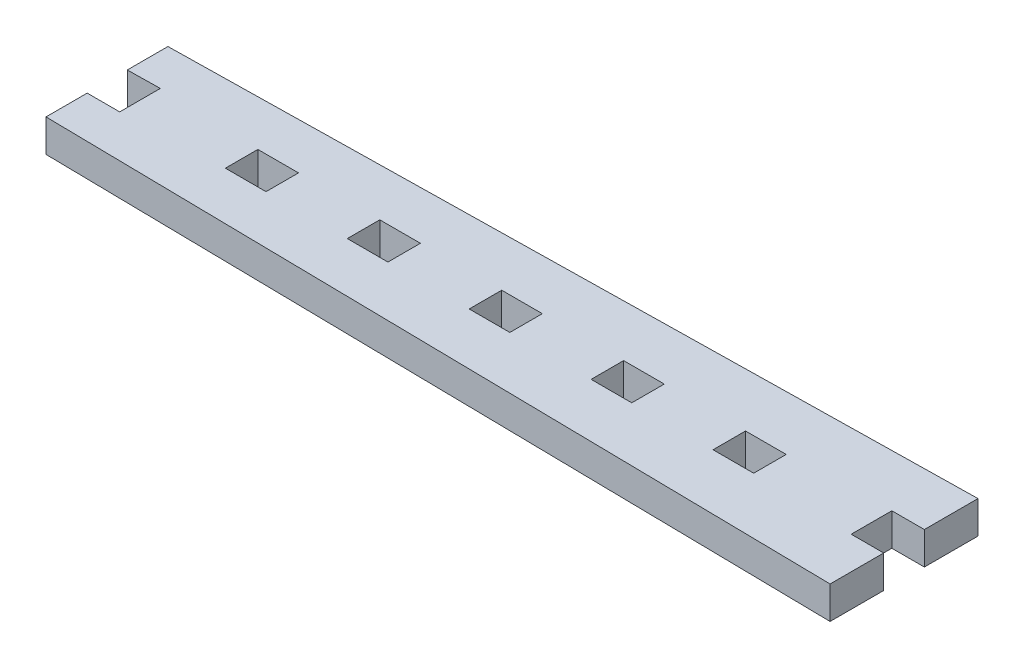
ISO-10303-21;
HEADER;
FILE_DESCRIPTION(('STEP AP214'),'2;1');
FILE_NAME('part.step','',(''),(''),'','','');
FILE_SCHEMA(('AUTOMOTIVE_DESIGN { 1 0 10303 214 1 1 1 1 }'));
ENDSEC;
DATA;
#1=APPLICATION_CONTEXT('core data for automotive mechanical design processes');
#2=APPLICATION_PROTOCOL_DEFINITION('international standard','automotive_design',2000,#1);
#3=PRODUCT_CONTEXT('',#1,'mechanical');
#4=PRODUCT('Part','Part','',(#3));
#5=PRODUCT_RELATED_PRODUCT_CATEGORY('part','',(#4));
#6=PRODUCT_DEFINITION_FORMATION('','',#4);
#7=PRODUCT_DEFINITION_CONTEXT('part definition',#1,'design');
#8=PRODUCT_DEFINITION('design','',#6,#7);
#9=PRODUCT_DEFINITION_SHAPE('','',#8);
#10=(LENGTH_UNIT() NAMED_UNIT(*) SI_UNIT(.MILLI.,.METRE.));
#11=(NAMED_UNIT(*) PLANE_ANGLE_UNIT() SI_UNIT($,.RADIAN.));
#12=(NAMED_UNIT(*) SI_UNIT($,.STERADIAN.) SOLID_ANGLE_UNIT());
#13=UNCERTAINTY_MEASURE_WITH_UNIT(LENGTH_MEASURE(1.E-05),#10,'distance_accuracy_value','');
#14=(GEOMETRIC_REPRESENTATION_CONTEXT(3) GLOBAL_UNCERTAINTY_ASSIGNED_CONTEXT((#13)) GLOBAL_UNIT_ASSIGNED_CONTEXT((#10,
#11,#12)) REPRESENTATION_CONTEXT('',''));
#15=CARTESIAN_POINT('',(0.,0.,0.));
#16=DIRECTION('',(0.,0.,1.));
#17=DIRECTION('',(1.,0.,0.));
#18=AXIS2_PLACEMENT_3D('',#15,#16,#17);
#19=CARTESIAN_POINT('',(96.7097699647949,0.,-6.98944296912171));
#20=DIRECTION('',(0.,0.,1.));
#21=DIRECTION('',(1.,0.,0.));
#22=AXIS2_PLACEMENT_3D('',#19,#20,#21);
#23=PLANE('',#22);
#24=DIRECTION('',(1.,0.,0.));
#25=VECTOR('',#24,1.);
#26=CARTESIAN_POINT('',(96.7097699647949,5.08,-6.98944296912171));
#27=LINE('',#26,#25);
#28=CARTESIAN_POINT('',(96.7097699647949,5.08,-6.98944296912171));
#29=VERTEX_POINT('',#28);
#30=CARTESIAN_POINT('',(103.059769964795,5.08,-6.98944296912171));
#31=VERTEX_POINT('',#30);
#32=EDGE_CURVE('E474',#29,#31,#27,.T.);
#33=ORIENTED_EDGE('',*,*,#32,.T.);
#34=DIRECTION('',(0.,1.,0.));
#35=VECTOR('',#34,1.);
#36=CARTESIAN_POINT('',(103.059769964795,0.,-6.98944296912171));
#37=LINE('',#36,#35);
#38=CARTESIAN_POINT('',(103.059769964795,0.,-6.98944296912171));
#39=VERTEX_POINT('',#38);
#40=EDGE_CURVE('E11',#39,#31,#37,.T.);
#41=ORIENTED_EDGE('',*,*,#40,.F.);
#42=DIRECTION('',(1.,0.,0.));
#43=VECTOR('',#42,1.);
#44=CARTESIAN_POINT('',(96.7097699647949,0.,-6.98944296912171));
#45=LINE('',#44,#43);
#46=CARTESIAN_POINT('',(96.7097699647949,0.,-6.98944296912171));
#47=VERTEX_POINT('',#46);
#48=EDGE_CURVE('E478',#47,#39,#45,.T.);
#49=ORIENTED_EDGE('',*,*,#48,.F.);
#50=DIRECTION('',(0.,1.,0.));
#51=VECTOR('',#50,1.);
#52=CARTESIAN_POINT('',(96.7097699647949,0.,-6.98944296912171));
#53=LINE('',#52,#51);
#54=EDGE_CURVE('E483',#47,#29,#53,.T.);
#55=ORIENTED_EDGE('',*,*,#54,.T.);
#56=EDGE_LOOP('',(#33,#41,#49,#55));
#57=FACE_BOUND('',#56,.T.);
#58=ADVANCED_FACE('F33',(#57),#23,.F.);
#59=CARTESIAN_POINT('',(103.059769964795,0.,-12.0694429691217));
#60=DIRECTION('',(1.,0.,0.));
#61=DIRECTION('',(0.,0.,-1.));
#62=AXIS2_PLACEMENT_3D('',#59,#60,#61);
#63=PLANE('',#62);
#64=DIRECTION('',(0.,0.,-1.));
#65=VECTOR('',#64,1.);
#66=CARTESIAN_POINT('',(103.059769964795,5.08,-12.0694429691217));
#67=LINE('',#66,#65);
#68=CARTESIAN_POINT('',(103.059769964795,5.08,-12.0694429691217));
#69=VERTEX_POINT('',#68);
#70=EDGE_CURVE('E471',#31,#69,#67,.T.);
#71=ORIENTED_EDGE('',*,*,#70,.T.);
#72=DIRECTION('',(0.,1.,0.));
#73=VECTOR('',#72,1.);
#74=CARTESIAN_POINT('',(103.059769964795,0.,-12.0694429691217));
#75=LINE('',#74,#73);
#76=CARTESIAN_POINT('',(103.059769964795,0.,-12.0694429691217));
#77=VERTEX_POINT('',#76);
#78=EDGE_CURVE('E40',#77,#69,#75,.T.);
#79=ORIENTED_EDGE('',*,*,#78,.F.);
#80=DIRECTION('',(0.,0.,-1.));
#81=VECTOR('',#80,1.);
#82=CARTESIAN_POINT('',(103.059769964795,0.,-12.0694429691217));
#83=LINE('',#82,#81);
#84=EDGE_CURVE('E54',#39,#77,#83,.T.);
#85=ORIENTED_EDGE('',*,*,#84,.F.);
#86=ORIENTED_EDGE('',*,*,#40,.T.);
#87=EDGE_LOOP('',(#71,#79,#85,#86));
#88=FACE_BOUND('',#87,.T.);
#89=ADVANCED_FACE('F493',(#88),#63,.F.);
#90=CARTESIAN_POINT('',(96.7097699647949,0.,-12.0694429691217));
#91=DIRECTION('',(0.,0.,-1.));
#92=DIRECTION('',(-1.,0.,0.));
#93=AXIS2_PLACEMENT_3D('',#90,#91,#92);
#94=PLANE('',#93);
#95=DIRECTION('',(-1.,0.,0.));
#96=VECTOR('',#95,1.);
#97=CARTESIAN_POINT('',(96.7097699647949,5.08,-12.0694429691217));
#98=LINE('',#97,#96);
#99=CARTESIAN_POINT('',(96.7097699647949,5.08,-12.0694429691217));
#100=VERTEX_POINT('',#99);
#101=EDGE_CURVE('E468',#69,#100,#98,.T.);
#102=ORIENTED_EDGE('',*,*,#101,.T.);
#103=DIRECTION('',(0.,1.,0.));
#104=VECTOR('',#103,1.);
#105=CARTESIAN_POINT('',(96.7097699647949,0.,-12.0694429691217));
#106=LINE('',#105,#104);
#107=CARTESIAN_POINT('',(96.7097699647949,0.,-12.0694429691217));
#108=VERTEX_POINT('',#107);
#109=EDGE_CURVE('E486',#108,#100,#106,.T.);
#110=ORIENTED_EDGE('',*,*,#109,.F.);
#111=DIRECTION('',(-1.,0.,0.));
#112=VECTOR('',#111,1.);
#113=CARTESIAN_POINT('',(96.7097699647949,0.,-12.0694429691217));
#114=LINE('',#113,#112);
#115=EDGE_CURVE('E481',#77,#108,#114,.T.);
#116=ORIENTED_EDGE('',*,*,#115,.F.);
#117=ORIENTED_EDGE('',*,*,#78,.T.);
#118=EDGE_LOOP('',(#102,#110,#116,#117));
#119=FACE_BOUND('',#118,.T.);
#120=ADVANCED_FACE('F490',(#119),#94,.F.);
#121=CARTESIAN_POINT('',(96.7097699647949,0.,-12.0694429691217));
#122=DIRECTION('',(-1.,0.,0.));
#123=DIRECTION('',(0.,0.,1.));
#124=AXIS2_PLACEMENT_3D('',#121,#122,#123);
#125=PLANE('',#124);
#126=DIRECTION('',(0.,0.,1.));
#127=VECTOR('',#126,1.);
#128=CARTESIAN_POINT('',(96.7097699647949,5.08,-12.0694429691217));
#129=LINE('',#128,#127);
#130=EDGE_CURVE('E466',#100,#29,#129,.T.);
#131=ORIENTED_EDGE('',*,*,#130,.T.);
#132=ORIENTED_EDGE('',*,*,#54,.F.);
#133=DIRECTION('',(0.,0.,1.));
#134=VECTOR('',#133,1.);
#135=CARTESIAN_POINT('',(96.7097699647949,0.,-12.0694429691217));
#136=LINE('',#135,#134);
#137=EDGE_CURVE('E47',#108,#47,#136,.T.);
#138=ORIENTED_EDGE('',*,*,#137,.F.);
#139=ORIENTED_EDGE('',*,*,#109,.T.);
#140=EDGE_LOOP('',(#131,#132,#138,#139));
#141=FACE_BOUND('',#140,.T.);
#142=ADVANCED_FACE('F499',(#141),#125,.F.);
#143=CARTESIAN_POINT('',(77.6597699647949,0.,-6.9894429691217));
#144=DIRECTION('',(0.,0.,1.));
#145=DIRECTION('',(1.,0.,0.));
#146=AXIS2_PLACEMENT_3D('',#143,#144,#145);
#147=PLANE('',#146);
#148=DIRECTION('',(1.,0.,0.));
#149=VECTOR('',#148,1.);
#150=CARTESIAN_POINT('',(77.6597699647949,5.08,-6.9894429691217));
#151=LINE('',#150,#149);
#152=CARTESIAN_POINT('',(77.6597699647949,5.08,-6.9894429691217));
#153=VERTEX_POINT('',#152);
#154=CARTESIAN_POINT('',(84.0097699647949,5.08,-6.98944296912171));
#155=VERTEX_POINT('',#154);
#156=EDGE_CURVE('E442',#153,#155,#151,.T.);
#157=ORIENTED_EDGE('',*,*,#156,.T.);
#158=DIRECTION('',(0.,1.,0.));
#159=VECTOR('',#158,1.);
#160=CARTESIAN_POINT('',(84.0097699647949,0.,-6.98944296912171));
#161=LINE('',#160,#159);
#162=CARTESIAN_POINT('',(84.0097699647949,0.,-6.98944296912171));
#163=VERTEX_POINT('',#162);
#164=EDGE_CURVE('E463',#163,#155,#161,.T.);
#165=ORIENTED_EDGE('',*,*,#164,.F.);
#166=DIRECTION('',(1.,0.,0.));
#167=VECTOR('',#166,1.);
#168=CARTESIAN_POINT('',(77.6597699647949,0.,-6.9894429691217));
#169=LINE('',#168,#167);
#170=CARTESIAN_POINT('',(77.6597699647949,0.,-6.9894429691217));
#171=VERTEX_POINT('',#170);
#172=EDGE_CURVE('E447',#171,#163,#169,.T.);
#173=ORIENTED_EDGE('',*,*,#172,.F.);
#174=DIRECTION('',(0.,1.,0.));
#175=VECTOR('',#174,1.);
#176=CARTESIAN_POINT('',(77.6597699647949,0.,-6.9894429691217));
#177=LINE('',#176,#175);
#178=EDGE_CURVE('E454',#171,#153,#177,.T.);
#179=ORIENTED_EDGE('',*,*,#178,.T.);
#180=EDGE_LOOP('',(#157,#165,#173,#179));
#181=FACE_BOUND('',#180,.T.);
#182=ADVANCED_FACE('F501',(#181),#147,.F.);
#183=CARTESIAN_POINT('',(84.0097699647949,0.,-12.0694429691217));
#184=DIRECTION('',(1.,0.,0.));
#185=DIRECTION('',(0.,0.,-1.));
#186=AXIS2_PLACEMENT_3D('',#183,#184,#185);
#187=PLANE('',#186);
#188=DIRECTION('',(0.,0.,-1.));
#189=VECTOR('',#188,1.);
#190=CARTESIAN_POINT('',(84.0097699647949,5.08,-12.0694429691217));
#191=LINE('',#190,#189);
#192=CARTESIAN_POINT('',(84.0097699647949,5.08,-12.0694429691217));
#193=VERTEX_POINT('',#192);
#194=EDGE_CURVE('E439',#155,#193,#191,.T.);
#195=ORIENTED_EDGE('',*,*,#194,.T.);
#196=DIRECTION('',(0.,1.,0.));
#197=VECTOR('',#196,1.);
#198=CARTESIAN_POINT('',(84.0097699647949,0.,-12.0694429691217));
#199=LINE('',#198,#197);
#200=CARTESIAN_POINT('',(84.0097699647949,0.,-12.0694429691217));
#201=VERTEX_POINT('',#200);
#202=EDGE_CURVE('E460',#201,#193,#199,.T.);
#203=ORIENTED_EDGE('',*,*,#202,.F.);
#204=DIRECTION('',(0.,0.,-1.));
#205=VECTOR('',#204,1.);
#206=CARTESIAN_POINT('',(84.0097699647949,0.,-12.0694429691217));
#207=LINE('',#206,#205);
#208=EDGE_CURVE('E449',#163,#201,#207,.T.);
#209=ORIENTED_EDGE('',*,*,#208,.F.);
#210=ORIENTED_EDGE('',*,*,#164,.T.);
#211=EDGE_LOOP('',(#195,#203,#209,#210));
#212=FACE_BOUND('',#211,.T.);
#213=ADVANCED_FACE('F507',(#212),#187,.F.);
#214=CARTESIAN_POINT('',(77.6597699647949,0.,-12.0694429691217));
#215=DIRECTION('',(0.,0.,-1.));
#216=DIRECTION('',(-1.,0.,0.));
#217=AXIS2_PLACEMENT_3D('',#214,#215,#216);
#218=PLANE('',#217);
#219=DIRECTION('',(-1.,0.,0.));
#220=VECTOR('',#219,1.);
#221=CARTESIAN_POINT('',(77.6597699647949,5.08,-12.0694429691217));
#222=LINE('',#221,#220);
#223=CARTESIAN_POINT('',(77.6597699647949,5.08,-12.0694429691217));
#224=VERTEX_POINT('',#223);
#225=EDGE_CURVE('E436',#193,#224,#222,.T.);
#226=ORIENTED_EDGE('',*,*,#225,.T.);
#227=DIRECTION('',(0.,1.,0.));
#228=VECTOR('',#227,1.);
#229=CARTESIAN_POINT('',(77.6597699647949,0.,-12.0694429691217));
#230=LINE('',#229,#228);
#231=CARTESIAN_POINT('',(77.6597699647949,0.,-12.0694429691217));
#232=VERTEX_POINT('',#231);
#233=EDGE_CURVE('E457',#232,#224,#230,.T.);
#234=ORIENTED_EDGE('',*,*,#233,.F.);
#235=DIRECTION('',(-1.,0.,0.));
#236=VECTOR('',#235,1.);
#237=CARTESIAN_POINT('',(77.6597699647949,0.,-12.0694429691217));
#238=LINE('',#237,#236);
#239=EDGE_CURVE('E451',#201,#232,#238,.T.);
#240=ORIENTED_EDGE('',*,*,#239,.F.);
#241=ORIENTED_EDGE('',*,*,#202,.T.);
#242=EDGE_LOOP('',(#226,#234,#240,#241));
#243=FACE_BOUND('',#242,.T.);
#244=ADVANCED_FACE('F540',(#243),#218,.F.);
#245=CARTESIAN_POINT('',(77.6597699647949,0.,-12.0694429691217));
#246=DIRECTION('',(-1.,0.,0.));
#247=DIRECTION('',(0.,0.,1.));
#248=AXIS2_PLACEMENT_3D('',#245,#246,#247);
#249=PLANE('',#248);
#250=DIRECTION('',(0.,0.,1.));
#251=VECTOR('',#250,1.);
#252=CARTESIAN_POINT('',(77.6597699647949,5.08,-12.0694429691217));
#253=LINE('',#252,#251);
#254=EDGE_CURVE('E434',#224,#153,#253,.T.);
#255=ORIENTED_EDGE('',*,*,#254,.T.);
#256=ORIENTED_EDGE('',*,*,#178,.F.);
#257=DIRECTION('',(0.,0.,1.));
#258=VECTOR('',#257,1.);
#259=CARTESIAN_POINT('',(77.6597699647949,0.,-12.0694429691217));
#260=LINE('',#259,#258);
#261=EDGE_CURVE('E445',#232,#171,#260,.T.);
#262=ORIENTED_EDGE('',*,*,#261,.F.);
#263=ORIENTED_EDGE('',*,*,#233,.T.);
#264=EDGE_LOOP('',(#255,#256,#262,#263));
#265=FACE_BOUND('',#264,.T.);
#266=ADVANCED_FACE('F550',(#265),#249,.F.);
#267=CARTESIAN_POINT('',(58.6097699647949,0.,-6.9894429691217));
#268=DIRECTION('',(0.,0.,1.));
#269=DIRECTION('',(1.,0.,0.));
#270=AXIS2_PLACEMENT_3D('',#267,#268,#269);
#271=PLANE('',#270);
#272=DIRECTION('',(1.,0.,0.));
#273=VECTOR('',#272,1.);
#274=CARTESIAN_POINT('',(58.6097699647949,5.08,-6.9894429691217));
#275=LINE('',#274,#273);
#276=CARTESIAN_POINT('',(58.6097699647949,5.08,-6.9894429691217));
#277=VERTEX_POINT('',#276);
#278=CARTESIAN_POINT('',(64.9597699647949,5.08,-6.9894429691217));
#279=VERTEX_POINT('',#278);
#280=EDGE_CURVE('E410',#277,#279,#275,.T.);
#281=ORIENTED_EDGE('',*,*,#280,.T.);
#282=DIRECTION('',(0.,1.,0.));
#283=VECTOR('',#282,1.);
#284=CARTESIAN_POINT('',(64.9597699647949,0.,-6.9894429691217));
#285=LINE('',#284,#283);
#286=CARTESIAN_POINT('',(64.9597699647949,0.,-6.9894429691217));
#287=VERTEX_POINT('',#286);
#288=EDGE_CURVE('E431',#287,#279,#285,.T.);
#289=ORIENTED_EDGE('',*,*,#288,.F.);
#290=DIRECTION('',(1.,0.,0.));
#291=VECTOR('',#290,1.);
#292=CARTESIAN_POINT('',(58.6097699647949,0.,-6.9894429691217));
#293=LINE('',#292,#291);
#294=CARTESIAN_POINT('',(58.6097699647949,0.,-6.9894429691217));
#295=VERTEX_POINT('',#294);
#296=EDGE_CURVE('E415',#295,#287,#293,.T.);
#297=ORIENTED_EDGE('',*,*,#296,.F.);
#298=DIRECTION('',(0.,1.,0.));
#299=VECTOR('',#298,1.);
#300=CARTESIAN_POINT('',(58.6097699647949,0.,-6.9894429691217));
#301=LINE('',#300,#299);
#302=EDGE_CURVE('E422',#295,#277,#301,.T.);
#303=ORIENTED_EDGE('',*,*,#302,.T.);
#304=EDGE_LOOP('',(#281,#289,#297,#303));
#305=FACE_BOUND('',#304,.T.);
#306=ADVANCED_FACE('F560',(#305),#271,.F.);
#307=CARTESIAN_POINT('',(64.9597699647949,0.,-12.0694429691217));
#308=DIRECTION('',(1.,0.,0.));
#309=DIRECTION('',(0.,0.,-1.));
#310=AXIS2_PLACEMENT_3D('',#307,#308,#309);
#311=PLANE('',#310);
#312=DIRECTION('',(0.,0.,-1.));
#313=VECTOR('',#312,1.);
#314=CARTESIAN_POINT('',(64.9597699647949,5.08,-12.0694429691217));
#315=LINE('',#314,#313);
#316=CARTESIAN_POINT('',(64.9597699647949,5.08,-12.0694429691217));
#317=VERTEX_POINT('',#316);
#318=EDGE_CURVE('E407',#279,#317,#315,.T.);
#319=ORIENTED_EDGE('',*,*,#318,.T.);
#320=DIRECTION('',(0.,1.,0.));
#321=VECTOR('',#320,1.);
#322=CARTESIAN_POINT('',(64.9597699647949,0.,-12.0694429691217));
#323=LINE('',#322,#321);
#324=CARTESIAN_POINT('',(64.9597699647949,0.,-12.0694429691217));
#325=VERTEX_POINT('',#324);
#326=EDGE_CURVE('E428',#325,#317,#323,.T.);
#327=ORIENTED_EDGE('',*,*,#326,.F.);
#328=DIRECTION('',(0.,0.,-1.));
#329=VECTOR('',#328,1.);
#330=CARTESIAN_POINT('',(64.9597699647949,0.,-12.0694429691217));
#331=LINE('',#330,#329);
#332=EDGE_CURVE('E417',#287,#325,#331,.T.);
#333=ORIENTED_EDGE('',*,*,#332,.F.);
#334=ORIENTED_EDGE('',*,*,#288,.T.);
#335=EDGE_LOOP('',(#319,#327,#333,#334));
#336=FACE_BOUND('',#335,.T.);
#337=ADVANCED_FACE('F570',(#336),#311,.F.);
#338=CARTESIAN_POINT('',(58.6097699647949,0.,-12.0694429691217));
#339=DIRECTION('',(0.,0.,-1.));
#340=DIRECTION('',(-1.,0.,0.));
#341=AXIS2_PLACEMENT_3D('',#338,#339,#340);
#342=PLANE('',#341);
#343=DIRECTION('',(-1.,0.,0.));
#344=VECTOR('',#343,1.);
#345=CARTESIAN_POINT('',(58.6097699647949,5.08,-12.0694429691217));
#346=LINE('',#345,#344);
#347=CARTESIAN_POINT('',(58.6097699647949,5.08,-12.0694429691217));
#348=VERTEX_POINT('',#347);
#349=EDGE_CURVE('E404',#317,#348,#346,.T.);
#350=ORIENTED_EDGE('',*,*,#349,.T.);
#351=DIRECTION('',(0.,1.,0.));
#352=VECTOR('',#351,1.);
#353=CARTESIAN_POINT('',(58.6097699647949,0.,-12.0694429691217));
#354=LINE('',#353,#352);
#355=CARTESIAN_POINT('',(58.6097699647949,0.,-12.0694429691217));
#356=VERTEX_POINT('',#355);
#357=EDGE_CURVE('E425',#356,#348,#354,.T.);
#358=ORIENTED_EDGE('',*,*,#357,.F.);
#359=DIRECTION('',(-1.,0.,0.));
#360=VECTOR('',#359,1.);
#361=CARTESIAN_POINT('',(58.6097699647949,0.,-12.0694429691217));
#362=LINE('',#361,#360);
#363=EDGE_CURVE('E419',#325,#356,#362,.T.);
#364=ORIENTED_EDGE('',*,*,#363,.F.);
#365=ORIENTED_EDGE('',*,*,#326,.T.);
#366=EDGE_LOOP('',(#350,#358,#364,#365));
#367=FACE_BOUND('',#366,.T.);
#368=ADVANCED_FACE('F580',(#367),#342,.F.);
#369=CARTESIAN_POINT('',(58.6097699647949,0.,-12.0694429691217));
#370=DIRECTION('',(-1.,0.,0.));
#371=DIRECTION('',(0.,0.,1.));
#372=AXIS2_PLACEMENT_3D('',#369,#370,#371);
#373=PLANE('',#372);
#374=DIRECTION('',(0.,0.,1.));
#375=VECTOR('',#374,1.);
#376=CARTESIAN_POINT('',(58.6097699647949,5.08,-12.0694429691217));
#377=LINE('',#376,#375);
#378=EDGE_CURVE('E402',#348,#277,#377,.T.);
#379=ORIENTED_EDGE('',*,*,#378,.T.);
#380=ORIENTED_EDGE('',*,*,#302,.F.);
#381=DIRECTION('',(0.,0.,1.));
#382=VECTOR('',#381,1.);
#383=CARTESIAN_POINT('',(58.6097699647949,0.,-12.0694429691217));
#384=LINE('',#383,#382);
#385=EDGE_CURVE('E413',#356,#295,#384,.T.);
#386=ORIENTED_EDGE('',*,*,#385,.F.);
#387=ORIENTED_EDGE('',*,*,#357,.T.);
#388=EDGE_LOOP('',(#379,#380,#386,#387));
#389=FACE_BOUND('',#388,.T.);
#390=ADVANCED_FACE('F590',(#389),#373,.F.);
#391=CARTESIAN_POINT('',(-0.445230035205121,5.08,0.0810545153470885));
#392=DIRECTION('',(1.,0.,0.));
#393=DIRECTION('',(0.,0.,-1.));
#394=AXIS2_PLACEMENT_3D('',#391,#392,#393);
#395=PLANE('',#394);
#396=DIRECTION('',(0.,0.,1.));
#397=VECTOR('',#396,1.);
#398=CARTESIAN_POINT('',(-0.445230035205121,0.,0.0810545153470885));
#399=LINE('',#398,#397);
#400=CARTESIAN_POINT('',(-0.445230035205122,0.,-6.35444296912168));
#401=VERTEX_POINT('',#400);
#402=CARTESIAN_POINT('',(-0.445230035205121,0.,0.0810545153470885));
#403=VERTEX_POINT('',#402);
#404=EDGE_CURVE('E310',#401,#403,#399,.T.);
#405=ORIENTED_EDGE('',*,*,#404,.T.);
#406=DIRECTION('',(0.,-1.,0.));
#407=VECTOR('',#406,1.);
#408=CARTESIAN_POINT('',(-0.445230035205121,5.08,0.0810545153470885));
#409=LINE('',#408,#407);
#410=CARTESIAN_POINT('',(-0.445230035205121,5.08,0.0810545153470885));
#411=VERTEX_POINT('',#410);
#412=EDGE_CURVE('E399',#411,#403,#409,.T.);
#413=ORIENTED_EDGE('',*,*,#412,.F.);
#414=DIRECTION('',(0.,0.,1.));
#415=VECTOR('',#414,1.);
#416=CARTESIAN_POINT('',(-0.445230035205121,5.08,0.0810545153470885));
#417=LINE('',#416,#415);
#418=CARTESIAN_POINT('',(-0.445230035205122,5.08,-6.35444296912168));
#419=VERTEX_POINT('',#418);
#420=EDGE_CURVE('E317',#419,#411,#417,.T.);
#421=ORIENTED_EDGE('',*,*,#420,.F.);
#422=DIRECTION('',(0.,-1.,0.));
#423=VECTOR('',#422,1.);
#424=CARTESIAN_POINT('',(-0.445230035205122,5.08,-6.35444296912168));
#425=LINE('',#424,#423);
#426=EDGE_CURVE('E343',#419,#401,#425,.T.);
#427=ORIENTED_EDGE('',*,*,#426,.T.);
#428=EDGE_LOOP('',(#405,#413,#421,#427));
#429=FACE_BOUND('',#428,.T.);
#430=ADVANCED_FACE('F600',(#429),#395,.F.);
#431=CARTESIAN_POINT('',(-0.445230035205121,5.08,0.0810545153470885));
#432=DIRECTION('',(0.0156376707800319,0.,-0.999877724150596));
#433=DIRECTION('',(-0.999877724150596,0.,-0.0156376707800319));
#434=AXIS2_PLACEMENT_3D('',#431,#432,#433);
#435=PLANE('',#434);
#436=DIRECTION('',(0.999877724150596,0.,0.0156376707800319));
#437=VECTOR('',#436,1.);
#438=CARTESIAN_POINT('',(-0.445230035205121,0.,0.0810545153470885));
#439=LINE('',#438,#437);
#440=CARTESIAN_POINT('',(124.014769964795,0.,2.02755703087831));
#441=VERTEX_POINT('',#440);
#442=EDGE_CURVE('E346',#403,#441,#439,.T.);
#443=ORIENTED_EDGE('',*,*,#442,.T.);
#444=DIRECTION('',(0.,-1.,0.));
#445=VECTOR('',#444,1.);
#446=CARTESIAN_POINT('',(124.014769964795,5.08,2.02755703087831));
#447=LINE('',#446,#445);
#448=CARTESIAN_POINT('',(124.014769964795,5.08,2.02755703087831));
#449=VERTEX_POINT('',#448);
#450=EDGE_CURVE('E396',#449,#441,#447,.T.);
#451=ORIENTED_EDGE('',*,*,#450,.F.);
#452=DIRECTION('',(0.999877724150596,0.,0.0156376707800319));
#453=VECTOR('',#452,1.);
#454=CARTESIAN_POINT('',(-0.445230035205121,5.08,0.0810545153470885));
#455=LINE('',#454,#453);
#456=EDGE_CURVE('E320',#411,#449,#455,.T.);
#457=ORIENTED_EDGE('',*,*,#456,.F.);
#458=ORIENTED_EDGE('',*,*,#412,.T.);
#459=EDGE_LOOP('',(#443,#451,#457,#458));
#460=FACE_BOUND('',#459,.T.);
#461=ADVANCED_FACE('F718',(#460),#435,.F.);
#462=CARTESIAN_POINT('',(124.014769964795,5.08,2.02755703087831));
#463=DIRECTION('',(-1.,0.,0.));
#464=DIRECTION('',(0.,0.,1.));
#465=AXIS2_PLACEMENT_3D('',#462,#463,#464);
#466=PLANE('',#465);
#467=DIRECTION('',(0.,0.,-1.));
#468=VECTOR('',#467,1.);
#469=CARTESIAN_POINT('',(124.014769964795,0.,2.02755703087831));
#470=LINE('',#469,#468);
#471=CARTESIAN_POINT('',(124.014769964795,0.,-6.35444296912169));
#472=VERTEX_POINT('',#471);
#473=EDGE_CURVE('E348',#441,#472,#470,.T.);
#474=ORIENTED_EDGE('',*,*,#473,.T.);
#475=DIRECTION('',(0.,-1.,0.));
#476=VECTOR('',#475,1.);
#477=CARTESIAN_POINT('',(124.014769964795,5.08,-6.35444296912169));
#478=LINE('',#477,#476);
#479=CARTESIAN_POINT('',(124.014769964795,5.08,-6.35444296912169));
#480=VERTEX_POINT('',#479);
#481=EDGE_CURVE('E393',#480,#472,#478,.T.);
#482=ORIENTED_EDGE('',*,*,#481,.F.);
#483=DIRECTION('',(0.,0.,-1.));
#484=VECTOR('',#483,1.);
#485=CARTESIAN_POINT('',(124.014769964795,5.08,2.02755703087831));
#486=LINE('',#485,#484);
#487=EDGE_CURVE('E323',#449,#480,#486,.T.);
#488=ORIENTED_EDGE('',*,*,#487,.F.);
#489=ORIENTED_EDGE('',*,*,#450,.T.);
#490=EDGE_LOOP('',(#474,#482,#488,#489));
#491=FACE_BOUND('',#490,.T.);
#492=ADVANCED_FACE('F714',(#491),#466,.F.);
#493=CARTESIAN_POINT('',(124.014769964795,5.08,-6.35444296912169));
#494=DIRECTION('',(0.,0.,1.));
#495=DIRECTION('',(1.,0.,0.));
#496=AXIS2_PLACEMENT_3D('',#493,#494,#495);
#497=PLANE('',#496);
#498=DIRECTION('',(-1.,0.,0.));
#499=VECTOR('',#498,1.);
#500=CARTESIAN_POINT('',(124.014769964795,0.,-6.35444296912169));
#501=LINE('',#500,#499);
#502=CARTESIAN_POINT('',(118.934769964795,0.,-6.35444296912169));
#503=VERTEX_POINT('',#502);
#504=EDGE_CURVE('E350',#472,#503,#501,.T.);
#505=ORIENTED_EDGE('',*,*,#504,.T.);
#506=DIRECTION('',(0.,-1.,0.));
#507=VECTOR('',#506,1.);
#508=CARTESIAN_POINT('',(118.934769964795,5.08,-6.35444296912169));
#509=LINE('',#508,#507);
#510=CARTESIAN_POINT('',(118.934769964795,5.08,-6.35444296912169));
#511=VERTEX_POINT('',#510);
#512=EDGE_CURVE('E390',#511,#503,#509,.T.);
#513=ORIENTED_EDGE('',*,*,#512,.F.);
#514=DIRECTION('',(-1.,0.,0.));
#515=VECTOR('',#514,1.);
#516=CARTESIAN_POINT('',(124.014769964795,5.08,-6.35444296912169));
#517=LINE('',#516,#515);
#518=EDGE_CURVE('E325',#480,#511,#517,.T.);
#519=ORIENTED_EDGE('',*,*,#518,.F.);
#520=ORIENTED_EDGE('',*,*,#481,.T.);
#521=EDGE_LOOP('',(#505,#513,#519,#520));
#522=FACE_BOUND('',#521,.T.);
#523=ADVANCED_FACE('F710',(#522),#497,.F.);
#524=CARTESIAN_POINT('',(118.934769964795,5.08,-12.7044429691217));
#525=DIRECTION('',(-1.,0.,0.));
#526=DIRECTION('',(0.,0.,1.));
#527=AXIS2_PLACEMENT_3D('',#524,#525,#526);
#528=PLANE('',#527);
#529=DIRECTION('',(0.,0.,-1.));
#530=VECTOR('',#529,1.);
#531=CARTESIAN_POINT('',(118.934769964795,0.,-12.7044429691217));
#532=LINE('',#531,#530);
#533=CARTESIAN_POINT('',(118.934769964795,0.,-12.7044429691217));
#534=VERTEX_POINT('',#533);
#535=EDGE_CURVE('E352',#503,#534,#532,.T.);
#536=ORIENTED_EDGE('',*,*,#535,.T.);
#537=DIRECTION('',(0.,-1.,0.));
#538=VECTOR('',#537,1.);
#539=CARTESIAN_POINT('',(118.934769964795,5.08,-12.7044429691217));
#540=LINE('',#539,#538);
#541=CARTESIAN_POINT('',(118.934769964795,5.08,-12.7044429691217));
#542=VERTEX_POINT('',#541);
#543=EDGE_CURVE('E387',#542,#534,#540,.T.);
#544=ORIENTED_EDGE('',*,*,#543,.F.);
#545=DIRECTION('',(0.,0.,-1.));
#546=VECTOR('',#545,1.);
#547=CARTESIAN_POINT('',(118.934769964795,5.08,-12.7044429691217));
#548=LINE('',#547,#546);
#549=EDGE_CURVE('E327',#511,#542,#548,.T.);
#550=ORIENTED_EDGE('',*,*,#549,.F.);
#551=ORIENTED_EDGE('',*,*,#512,.T.);
#552=EDGE_LOOP('',(#536,#544,#550,#551));
#553=FACE_BOUND('',#552,.T.);
#554=ADVANCED_FACE('F706',(#553),#528,.F.);
#555=CARTESIAN_POINT('',(124.014769964795,5.08,-12.7044429691217));
#556=DIRECTION('',(0.,0.,-1.));
#557=DIRECTION('',(-1.,0.,0.));
#558=AXIS2_PLACEMENT_3D('',#555,#556,#557);
#559=PLANE('',#558);
#560=DIRECTION('',(1.,0.,0.));
#561=VECTOR('',#560,1.);
#562=CARTESIAN_POINT('',(124.014769964795,0.,-12.7044429691217));
#563=LINE('',#562,#561);
#564=CARTESIAN_POINT('',(124.014769964795,0.,-12.7044429691217));
#565=VERTEX_POINT('',#564);
#566=EDGE_CURVE('E354',#534,#565,#563,.T.);
#567=ORIENTED_EDGE('',*,*,#566,.T.);
#568=DIRECTION('',(0.,-1.,0.));
#569=VECTOR('',#568,1.);
#570=CARTESIAN_POINT('',(124.014769964795,5.08,-12.7044429691217));
#571=LINE('',#570,#569);
#572=CARTESIAN_POINT('',(124.014769964795,5.08,-12.7044429691217));
#573=VERTEX_POINT('',#572);
#574=EDGE_CURVE('E384',#573,#565,#571,.T.);
#575=ORIENTED_EDGE('',*,*,#574,.F.);
#576=DIRECTION('',(1.,0.,0.));
#577=VECTOR('',#576,1.);
#578=CARTESIAN_POINT('',(124.014769964795,5.08,-12.7044429691217));
#579=LINE('',#578,#577);
#580=EDGE_CURVE('E329',#542,#573,#579,.T.);
#581=ORIENTED_EDGE('',*,*,#580,.F.);
#582=ORIENTED_EDGE('',*,*,#543,.T.);
#583=EDGE_LOOP('',(#567,#575,#581,#582));
#584=FACE_BOUND('',#583,.T.);
#585=ADVANCED_FACE('F702',(#584),#559,.F.);
#586=CARTESIAN_POINT('',(124.014769964795,5.08,-12.7044429691217));
#587=DIRECTION('',(-1.,0.,0.));
#588=DIRECTION('',(0.,0.,1.));
#589=AXIS2_PLACEMENT_3D('',#586,#587,#588);
#590=PLANE('',#589);
#591=DIRECTION('',(0.,0.,-1.));
#592=VECTOR('',#591,1.);
#593=CARTESIAN_POINT('',(124.014769964795,0.,-12.7044429691217));
#594=LINE('',#593,#592);
#595=CARTESIAN_POINT('',(124.014769964795,0.,-21.0864429691217));
#596=VERTEX_POINT('',#595);
#597=EDGE_CURVE('E356',#565,#596,#594,.T.);
#598=ORIENTED_EDGE('',*,*,#597,.T.);
#599=DIRECTION('',(0.,-1.,0.));
#600=VECTOR('',#599,1.);
#601=CARTESIAN_POINT('',(124.014769964795,5.08,-21.0864429691217));
#602=LINE('',#601,#600);
#603=CARTESIAN_POINT('',(124.014769964795,5.08,-21.0864429691217));
#604=VERTEX_POINT('',#603);
#605=EDGE_CURVE('E381',#604,#596,#602,.T.);
#606=ORIENTED_EDGE('',*,*,#605,.F.);
#607=DIRECTION('',(0.,0.,-1.));
#608=VECTOR('',#607,1.);
#609=CARTESIAN_POINT('',(124.014769964795,5.08,-12.7044429691217));
#610=LINE('',#609,#608);
#611=EDGE_CURVE('E331',#573,#604,#610,.T.);
#612=ORIENTED_EDGE('',*,*,#611,.F.);
#613=ORIENTED_EDGE('',*,*,#574,.T.);
#614=EDGE_LOOP('',(#598,#606,#612,#613));
#615=FACE_BOUND('',#614,.T.);
#616=ADVANCED_FACE('F698',(#615),#590,.F.);
#617=CARTESIAN_POINT('',(-0.444494961658314,5.08,-18.9689454704709));
#618=DIRECTION('',(0.0170111168424173,0.,0.999855300482912));
#619=DIRECTION('',(0.999855300482912,0.,-0.0170111168424173));
#620=AXIS2_PLACEMENT_3D('',#617,#618,#619);
#621=PLANE('',#620);
#622=DIRECTION('',(-0.999855300482912,0.,0.0170111168424173));
#623=VECTOR('',#622,1.);
#624=CARTESIAN_POINT('',(-0.444494961658314,0.,-18.9689454704709));
#625=LINE('',#624,#623);
#626=CARTESIAN_POINT('',(-0.444494961658314,0.,-18.9689454704709));
#627=VERTEX_POINT('',#626);
#628=EDGE_CURVE('E358',#596,#627,#625,.T.);
#629=ORIENTED_EDGE('',*,*,#628,.T.);
#630=DIRECTION('',(0.,-1.,0.));
#631=VECTOR('',#630,1.);
#632=CARTESIAN_POINT('',(-0.444494961658314,5.08,-18.9689454704709));
#633=LINE('',#632,#631);
#634=CARTESIAN_POINT('',(-0.444494961658314,5.08,-18.9689454704709));
#635=VERTEX_POINT('',#634);
#636=EDGE_CURVE('E378',#635,#627,#633,.T.);
#637=ORIENTED_EDGE('',*,*,#636,.F.);
#638=DIRECTION('',(-0.999855300482912,0.,0.0170111168424173));
#639=VECTOR('',#638,1.);
#640=CARTESIAN_POINT('',(-0.444494961658314,5.08,-18.9689454704709));
#641=LINE('',#640,#639);
#642=EDGE_CURVE('E333',#604,#635,#641,.T.);
#643=ORIENTED_EDGE('',*,*,#642,.F.);
#644=ORIENTED_EDGE('',*,*,#605,.T.);
#645=EDGE_LOOP('',(#629,#637,#643,#644));
#646=FACE_BOUND('',#645,.T.);
#647=ADVANCED_FACE('F694',(#646),#621,.F.);
#648=CARTESIAN_POINT('',(-0.444494961658314,5.08,-12.6180264955622));
#649=DIRECTION('',(1.,0.,0.));
#650=DIRECTION('',(0.,0.,-1.));
#651=AXIS2_PLACEMENT_3D('',#648,#649,#650);
#652=PLANE('',#651);
#653=DIRECTION('',(0.,0.,1.));
#654=VECTOR('',#653,1.);
#655=CARTESIAN_POINT('',(-0.444494961658314,0.,-12.6180264955622));
#656=LINE('',#655,#654);
#657=CARTESIAN_POINT('',(-0.444494961658314,0.,-12.6180264955622));
#658=VERTEX_POINT('',#657);
#659=EDGE_CURVE('E360',#627,#658,#656,.T.);
#660=ORIENTED_EDGE('',*,*,#659,.T.);
#661=DIRECTION('',(0.,-1.,0.));
#662=VECTOR('',#661,1.);
#663=CARTESIAN_POINT('',(-0.444494961658314,5.08,-12.6180264955622));
#664=LINE('',#663,#662);
#665=CARTESIAN_POINT('',(-0.444494961658314,5.08,-12.6180264955622));
#666=VERTEX_POINT('',#665);
#667=EDGE_CURVE('E375',#666,#658,#664,.T.);
#668=ORIENTED_EDGE('',*,*,#667,.F.);
#669=DIRECTION('',(0.,0.,1.));
#670=VECTOR('',#669,1.);
#671=CARTESIAN_POINT('',(-0.444494961658314,5.08,-12.6180264955622));
#672=LINE('',#671,#670);
#673=EDGE_CURVE('E335',#635,#666,#672,.T.);
#674=ORIENTED_EDGE('',*,*,#673,.F.);
#675=ORIENTED_EDGE('',*,*,#636,.T.);
#676=EDGE_LOOP('',(#660,#668,#674,#675));
#677=FACE_BOUND('',#676,.T.);
#678=ADVANCED_FACE('F690',(#677),#652,.F.);
#679=CARTESIAN_POINT('',(-0.444494961658314,5.08,-12.6180264955622));
#680=DIRECTION('',(-0.0170111168424177,0.,-0.999855300482912));
#681=DIRECTION('',(-0.999855300482912,0.,0.0170111168424177));
#682=AXIS2_PLACEMENT_3D('',#679,#680,#681);
#683=PLANE('',#682);
#684=DIRECTION('',(0.999855300482912,0.,-0.0170111168424177));
#685=VECTOR('',#684,1.);
#686=CARTESIAN_POINT('',(-0.444494961658314,0.,-12.6180264955622));
#687=LINE('',#686,#685);
#688=CARTESIAN_POINT('',(4.63476996479488,0.,-12.7044429691217));
#689=VERTEX_POINT('',#688);
#690=EDGE_CURVE('E362',#658,#689,#687,.T.);
#691=ORIENTED_EDGE('',*,*,#690,.T.);
#692=DIRECTION('',(0.,-1.,0.));
#693=VECTOR('',#692,1.);
#694=CARTESIAN_POINT('',(4.63476996479488,5.08,-12.7044429691217));
#695=LINE('',#694,#693);
#696=CARTESIAN_POINT('',(4.63476996479488,5.08,-12.7044429691217));
#697=VERTEX_POINT('',#696);
#698=EDGE_CURVE('E372',#697,#689,#695,.T.);
#699=ORIENTED_EDGE('',*,*,#698,.F.);
#700=DIRECTION('',(0.999855300482912,0.,-0.0170111168424177));
#701=VECTOR('',#700,1.);
#702=CARTESIAN_POINT('',(-0.444494961658314,5.08,-12.6180264955622));
#703=LINE('',#702,#701);
#704=EDGE_CURVE('E337',#666,#697,#703,.T.);
#705=ORIENTED_EDGE('',*,*,#704,.F.);
#706=ORIENTED_EDGE('',*,*,#667,.T.);
#707=EDGE_LOOP('',(#691,#699,#705,#706));
#708=FACE_BOUND('',#707,.T.);
#709=ADVANCED_FACE('F686',(#708),#683,.F.);
#710=CARTESIAN_POINT('',(4.63476996479488,5.08,-12.7044429691217));
#711=DIRECTION('',(1.,0.,0.));
#712=DIRECTION('',(0.,0.,-1.));
#713=AXIS2_PLACEMENT_3D('',#710,#711,#712);
#714=PLANE('',#713);
#715=DIRECTION('',(0.,0.,1.));
#716=VECTOR('',#715,1.);
#717=CARTESIAN_POINT('',(4.63476996479488,0.,-12.7044429691217));
#718=LINE('',#717,#716);
#719=CARTESIAN_POINT('',(4.63476996479488,0.,-6.35444296912168));
#720=VERTEX_POINT('',#719);
#721=EDGE_CURVE('E364',#689,#720,#718,.T.);
#722=ORIENTED_EDGE('',*,*,#721,.T.);
#723=DIRECTION('',(0.,-1.,0.));
#724=VECTOR('',#723,1.);
#725=CARTESIAN_POINT('',(4.63476996479488,5.08,-6.35444296912168));
#726=LINE('',#725,#724);
#727=CARTESIAN_POINT('',(4.63476996479488,5.08,-6.35444296912168));
#728=VERTEX_POINT('',#727);
#729=EDGE_CURVE('E369',#728,#720,#726,.T.);
#730=ORIENTED_EDGE('',*,*,#729,.F.);
#731=DIRECTION('',(0.,0.,1.));
#732=VECTOR('',#731,1.);
#733=CARTESIAN_POINT('',(4.63476996479488,5.08,-12.7044429691217));
#734=LINE('',#733,#732);
#735=EDGE_CURVE('E339',#697,#728,#734,.T.);
#736=ORIENTED_EDGE('',*,*,#735,.F.);
#737=ORIENTED_EDGE('',*,*,#698,.T.);
#738=EDGE_LOOP('',(#722,#730,#736,#737));
#739=FACE_BOUND('',#738,.T.);
#740=ADVANCED_FACE('F682',(#739),#714,.F.);
#741=CARTESIAN_POINT('',(-0.445230035205122,5.08,-6.35444296912168));
#742=DIRECTION('',(0.,0.,1.));
#743=DIRECTION('',(1.,0.,0.));
#744=AXIS2_PLACEMENT_3D('',#741,#742,#743);
#745=PLANE('',#744);
#746=DIRECTION('',(-1.,0.,0.));
#747=VECTOR('',#746,1.);
#748=CARTESIAN_POINT('',(-0.445230035205122,0.,-6.35444296912168));
#749=LINE('',#748,#747);
#750=EDGE_CURVE('E321',#720,#401,#749,.T.);
#751=ORIENTED_EDGE('',*,*,#750,.T.);
#752=ORIENTED_EDGE('',*,*,#426,.F.);
#753=DIRECTION('',(-1.,0.,0.));
#754=VECTOR('',#753,1.);
#755=CARTESIAN_POINT('',(-0.445230035205122,5.08,-6.35444296912168));
#756=LINE('',#755,#754);
#757=EDGE_CURVE('E341',#728,#419,#756,.T.);
#758=ORIENTED_EDGE('',*,*,#757,.F.);
#759=ORIENTED_EDGE('',*,*,#729,.T.);
#760=EDGE_LOOP('',(#751,#752,#758,#759));
#761=FACE_BOUND('',#760,.T.);
#762=ADVANCED_FACE('F613',(#761),#745,.F.);
#763=CARTESIAN_POINT('',(0.,5.08,0.));
#764=DIRECTION('',(0.,-1.,0.));
#765=DIRECTION('',(0.,0.,-1.));
#766=AXIS2_PLACEMENT_3D('',#763,#764,#765);
#767=PLANE('',#766);
#768=DIRECTION('',(1.,0.,0.));
#769=VECTOR('',#768,1.);
#770=CARTESIAN_POINT('',(39.5597699647949,5.08,-6.98944296912169));
#771=LINE('',#770,#769);
#772=CARTESIAN_POINT('',(39.5597699647949,5.08,-6.98944296912169));
#773=VERTEX_POINT('',#772);
#774=CARTESIAN_POINT('',(45.9097699647949,5.08,-6.98944296912169));
#775=VERTEX_POINT('',#774);
#776=EDGE_CURVE('E243',#773,#775,#771,.T.);
#777=ORIENTED_EDGE('',*,*,#776,.F.);
#778=DIRECTION('',(0.,0.,1.));
#779=VECTOR('',#778,1.);
#780=CARTESIAN_POINT('',(39.5597699647949,5.08,-12.0694429691217));
#781=LINE('',#780,#779);
#782=CARTESIAN_POINT('',(39.5597699647949,5.08,-12.0694429691217));
#783=VERTEX_POINT('',#782);
#784=EDGE_CURVE('E279',#783,#773,#781,.T.);
#785=ORIENTED_EDGE('',*,*,#784,.F.);
#786=DIRECTION('',(-1.,0.,0.));
#787=VECTOR('',#786,1.);
#788=CARTESIAN_POINT('',(39.5597699647949,5.08,-12.0694429691217));
#789=LINE('',#788,#787);
#790=CARTESIAN_POINT('',(45.9097699647949,5.08,-12.0694429691217));
#791=VERTEX_POINT('',#790);
#792=EDGE_CURVE('E265',#791,#783,#789,.T.);
#793=ORIENTED_EDGE('',*,*,#792,.F.);
#794=DIRECTION('',(0.,0.,-1.));
#795=VECTOR('',#794,1.);
#796=CARTESIAN_POINT('',(45.9097699647949,5.08,-12.0694429691217));
#797=LINE('',#796,#795);
#798=EDGE_CURVE('E257',#775,#791,#797,.T.);
#799=ORIENTED_EDGE('',*,*,#798,.F.);
#800=EDGE_LOOP('',(#777,#785,#793,#799));
#801=FACE_BOUND('',#800,.T.);
#802=DIRECTION('',(1.,0.,0.));
#803=VECTOR('',#802,1.);
#804=CARTESIAN_POINT('',(20.5097699647949,5.08,-6.98944296912168));
#805=LINE('',#804,#803);
#806=CARTESIAN_POINT('',(20.5097699647949,5.08,-6.98944296912168));
#807=VERTEX_POINT('',#806);
#808=CARTESIAN_POINT('',(26.8597699647949,5.08,-6.98944296912169));
#809=VERTEX_POINT('',#808);
#810=EDGE_CURVE('E300',#807,#809,#805,.T.);
#811=ORIENTED_EDGE('',*,*,#810,.F.);
#812=DIRECTION('',(0.,0.,1.));
#813=VECTOR('',#812,1.);
#814=CARTESIAN_POINT('',(20.5097699647949,5.08,-12.0694429691217));
#815=LINE('',#814,#813);
#816=CARTESIAN_POINT('',(20.5097699647949,5.08,-12.0694429691217));
#817=VERTEX_POINT('',#816);
#818=EDGE_CURVE('E284',#817,#807,#815,.T.);
#819=ORIENTED_EDGE('',*,*,#818,.F.);
#820=DIRECTION('',(-1.,0.,0.));
#821=VECTOR('',#820,1.);
#822=CARTESIAN_POINT('',(20.5097699647949,5.08,-12.0694429691217));
#823=LINE('',#822,#821);
#824=CARTESIAN_POINT('',(26.8597699647949,5.08,-12.0694429691217));
#825=VERTEX_POINT('',#824);
#826=EDGE_CURVE('E289',#825,#817,#823,.T.);
#827=ORIENTED_EDGE('',*,*,#826,.F.);
#828=DIRECTION('',(0.,0.,-1.));
#829=VECTOR('',#828,1.);
#830=CARTESIAN_POINT('',(26.8597699647949,5.08,-12.0694429691217));
#831=LINE('',#830,#829);
#832=EDGE_CURVE('E303',#809,#825,#831,.T.);
#833=ORIENTED_EDGE('',*,*,#832,.F.);
#834=EDGE_LOOP('',(#811,#819,#827,#833));
#835=FACE_BOUND('',#834,.T.);
#836=ORIENTED_EDGE('',*,*,#420,.T.);
#837=ORIENTED_EDGE('',*,*,#456,.T.);
#838=ORIENTED_EDGE('',*,*,#487,.T.);
#839=ORIENTED_EDGE('',*,*,#518,.T.);
#840=ORIENTED_EDGE('',*,*,#549,.T.);
#841=ORIENTED_EDGE('',*,*,#580,.T.);
#842=ORIENTED_EDGE('',*,*,#611,.T.);
#843=ORIENTED_EDGE('',*,*,#642,.T.);
#844=ORIENTED_EDGE('',*,*,#673,.T.);
#845=ORIENTED_EDGE('',*,*,#704,.T.);
#846=ORIENTED_EDGE('',*,*,#735,.T.);
#847=ORIENTED_EDGE('',*,*,#757,.T.);
#848=EDGE_LOOP('',(#836,#837,#838,#839,#840,#841,#842,#843,#844,#845,#846,#847));
#849=FACE_BOUND('',#848,.T.);
#850=ORIENTED_EDGE('',*,*,#378,.F.);
#851=ORIENTED_EDGE('',*,*,#349,.F.);
#852=ORIENTED_EDGE('',*,*,#318,.F.);
#853=ORIENTED_EDGE('',*,*,#280,.F.);
#854=EDGE_LOOP('',(#850,#851,#852,#853));
#855=FACE_BOUND('',#854,.T.);
#856=ORIENTED_EDGE('',*,*,#254,.F.);
#857=ORIENTED_EDGE('',*,*,#225,.F.);
#858=ORIENTED_EDGE('',*,*,#194,.F.);
#859=ORIENTED_EDGE('',*,*,#156,.F.);
#860=EDGE_LOOP('',(#856,#857,#858,#859));
#861=FACE_BOUND('',#860,.T.);
#862=ORIENTED_EDGE('',*,*,#130,.F.);
#863=ORIENTED_EDGE('',*,*,#101,.F.);
#864=ORIENTED_EDGE('',*,*,#70,.F.);
#865=ORIENTED_EDGE('',*,*,#32,.F.);
#866=EDGE_LOOP('',(#862,#863,#864,#865));
#867=FACE_BOUND('',#866,.T.);
#868=ADVANCED_FACE('F263',(#801,#835,#849,#855,#861,#867),#767,.F.);
#869=CARTESIAN_POINT('',(0.,0.,0.));
#870=DIRECTION('',(0.,-1.,0.));
#871=DIRECTION('',(0.,0.,-1.));
#872=AXIS2_PLACEMENT_3D('',#869,#870,#871);
#873=PLANE('',#872);
#874=DIRECTION('',(0.,0.,1.));
#875=VECTOR('',#874,1.);
#876=CARTESIAN_POINT('',(39.5597699647949,0.,-12.0694429691217));
#877=LINE('',#876,#875);
#878=CARTESIAN_POINT('',(39.5597699647949,0.,-12.0694429691217));
#879=VERTEX_POINT('',#878);
#880=CARTESIAN_POINT('',(39.5597699647949,0.,-6.98944296912169));
#881=VERTEX_POINT('',#880);
#882=EDGE_CURVE('E281',#879,#881,#877,.T.);
#883=ORIENTED_EDGE('',*,*,#882,.T.);
#884=DIRECTION('',(1.,0.,0.));
#885=VECTOR('',#884,1.);
#886=CARTESIAN_POINT('',(39.5597699647949,0.,-6.98944296912169));
#887=LINE('',#886,#885);
#888=CARTESIAN_POINT('',(45.9097699647949,0.,-6.98944296912169));
#889=VERTEX_POINT('',#888);
#890=EDGE_CURVE('E253',#881,#889,#887,.T.);
#891=ORIENTED_EDGE('',*,*,#890,.T.);
#892=DIRECTION('',(0.,0.,-1.));
#893=VECTOR('',#892,1.);
#894=CARTESIAN_POINT('',(45.9097699647949,0.,-12.0694429691217));
#895=LINE('',#894,#893);
#896=CARTESIAN_POINT('',(45.9097699647949,0.,-12.0694429691217));
#897=VERTEX_POINT('',#896);
#898=EDGE_CURVE('E260',#889,#897,#895,.T.);
#899=ORIENTED_EDGE('',*,*,#898,.T.);
#900=DIRECTION('',(-1.,0.,0.));
#901=VECTOR('',#900,1.);
#902=CARTESIAN_POINT('',(39.5597699647949,0.,-12.0694429691217));
#903=LINE('',#902,#901);
#904=EDGE_CURVE('E276',#897,#879,#903,.T.);
#905=ORIENTED_EDGE('',*,*,#904,.T.);
#906=EDGE_LOOP('',(#883,#891,#899,#905));
#907=FACE_BOUND('',#906,.T.);
#908=DIRECTION('',(0.,0.,1.));
#909=VECTOR('',#908,1.);
#910=CARTESIAN_POINT('',(20.5097699647949,0.,-12.0694429691217));
#911=LINE('',#910,#909);
#912=CARTESIAN_POINT('',(20.5097699647949,0.,-12.0694429691217));
#913=VERTEX_POINT('',#912);
#914=CARTESIAN_POINT('',(20.5097699647949,0.,-6.98944296912168));
#915=VERTEX_POINT('',#914);
#916=EDGE_CURVE('E285',#913,#915,#911,.T.);
#917=ORIENTED_EDGE('',*,*,#916,.T.);
#918=DIRECTION('',(1.,0.,0.));
#919=VECTOR('',#918,1.);
#920=CARTESIAN_POINT('',(20.5097699647949,0.,-6.98944296912168));
#921=LINE('',#920,#919);
#922=CARTESIAN_POINT('',(26.8597699647949,0.,-6.98944296912169));
#923=VERTEX_POINT('',#922);
#924=EDGE_CURVE('E288',#915,#923,#921,.T.);
#925=ORIENTED_EDGE('',*,*,#924,.T.);
#926=DIRECTION('',(0.,0.,-1.));
#927=VECTOR('',#926,1.);
#928=CARTESIAN_POINT('',(26.8597699647949,0.,-12.0694429691217));
#929=LINE('',#928,#927);
#930=CARTESIAN_POINT('',(26.8597699647949,0.,-12.0694429691217));
#931=VERTEX_POINT('',#930);
#932=EDGE_CURVE('E292',#923,#931,#929,.T.);
#933=ORIENTED_EDGE('',*,*,#932,.T.);
#934=DIRECTION('',(-1.,0.,0.));
#935=VECTOR('',#934,1.);
#936=CARTESIAN_POINT('',(20.5097699647949,0.,-12.0694429691217));
#937=LINE('',#936,#935);
#938=EDGE_CURVE('E295',#931,#913,#937,.T.);
#939=ORIENTED_EDGE('',*,*,#938,.T.);
#940=EDGE_LOOP('',(#917,#925,#933,#939));
#941=FACE_BOUND('',#940,.T.);
#942=ORIENTED_EDGE('',*,*,#404,.F.);
#943=ORIENTED_EDGE('',*,*,#750,.F.);
#944=ORIENTED_EDGE('',*,*,#721,.F.);
#945=ORIENTED_EDGE('',*,*,#690,.F.);
#946=ORIENTED_EDGE('',*,*,#659,.F.);
#947=ORIENTED_EDGE('',*,*,#628,.F.);
#948=ORIENTED_EDGE('',*,*,#597,.F.);
#949=ORIENTED_EDGE('',*,*,#566,.F.);
#950=ORIENTED_EDGE('',*,*,#535,.F.);
#951=ORIENTED_EDGE('',*,*,#504,.F.);
#952=ORIENTED_EDGE('',*,*,#473,.F.);
#953=ORIENTED_EDGE('',*,*,#442,.F.);
#954=EDGE_LOOP('',(#942,#943,#944,#945,#946,#947,#948,#949,#950,#951,#952,#953));
#955=FACE_BOUND('',#954,.T.);
#956=ORIENTED_EDGE('',*,*,#385,.T.);
#957=ORIENTED_EDGE('',*,*,#296,.T.);
#958=ORIENTED_EDGE('',*,*,#332,.T.);
#959=ORIENTED_EDGE('',*,*,#363,.T.);
#960=EDGE_LOOP('',(#956,#957,#958,#959));
#961=FACE_BOUND('',#960,.T.);
#962=ORIENTED_EDGE('',*,*,#261,.T.);
#963=ORIENTED_EDGE('',*,*,#172,.T.);
#964=ORIENTED_EDGE('',*,*,#208,.T.);
#965=ORIENTED_EDGE('',*,*,#239,.T.);
#966=EDGE_LOOP('',(#962,#963,#964,#965));
#967=FACE_BOUND('',#966,.T.);
#968=ORIENTED_EDGE('',*,*,#137,.T.);
#969=ORIENTED_EDGE('',*,*,#48,.T.);
#970=ORIENTED_EDGE('',*,*,#84,.T.);
#971=ORIENTED_EDGE('',*,*,#115,.T.);
#972=EDGE_LOOP('',(#968,#969,#970,#971));
#973=FACE_BOUND('',#972,.T.);
#974=ADVANCED_FACE('F612',(#907,#941,#955,#961,#967,#973),#873,.T.);
#975=CARTESIAN_POINT('',(20.5097699647949,0.,-12.0694429691217));
#976=DIRECTION('',(-1.,0.,0.));
#977=DIRECTION('',(0.,0.,1.));
#978=AXIS2_PLACEMENT_3D('',#975,#976,#977);
#979=PLANE('',#978);
#980=ORIENTED_EDGE('',*,*,#818,.T.);
#981=DIRECTION('',(0.,1.,0.));
#982=VECTOR('',#981,1.);
#983=CARTESIAN_POINT('',(20.5097699647949,0.,-6.98944296912168));
#984=LINE('',#983,#982);
#985=EDGE_CURVE('E298',#915,#807,#984,.T.);
#986=ORIENTED_EDGE('',*,*,#985,.F.);
#987=ORIENTED_EDGE('',*,*,#916,.F.);
#988=DIRECTION('',(0.,1.,0.));
#989=VECTOR('',#988,1.);
#990=CARTESIAN_POINT('',(20.5097699647949,0.,-12.0694429691217));
#991=LINE('',#990,#989);
#992=EDGE_CURVE('E308',#913,#817,#991,.T.);
#993=ORIENTED_EDGE('',*,*,#992,.T.);
#994=EDGE_LOOP('',(#980,#986,#987,#993));
#995=FACE_BOUND('',#994,.T.);
#996=ADVANCED_FACE('F624',(#995),#979,.F.);
#997=CARTESIAN_POINT('',(20.5097699647949,0.,-12.0694429691217));
#998=DIRECTION('',(0.,0.,-1.));
#999=DIRECTION('',(-1.,0.,0.));
#1000=AXIS2_PLACEMENT_3D('',#997,#998,#999);
#1001=PLANE('',#1000);
#1002=ORIENTED_EDGE('',*,*,#826,.T.);
#1003=ORIENTED_EDGE('',*,*,#992,.F.);
#1004=ORIENTED_EDGE('',*,*,#938,.F.);
#1005=DIRECTION('',(0.,1.,0.));
#1006=VECTOR('',#1005,1.);
#1007=CARTESIAN_POINT('',(26.8597699647949,0.,-12.0694429691217));
#1008=LINE('',#1007,#1006);
#1009=EDGE_CURVE('E311',#931,#825,#1008,.T.);
#1010=ORIENTED_EDGE('',*,*,#1009,.T.);
#1011=EDGE_LOOP('',(#1002,#1003,#1004,#1010));
#1012=FACE_BOUND('',#1011,.T.);
#1013=ADVANCED_FACE('F669',(#1012),#1001,.F.);
#1014=CARTESIAN_POINT('',(26.8597699647949,0.,-12.0694429691217));
#1015=DIRECTION('',(1.,0.,0.));
#1016=DIRECTION('',(0.,0.,-1.));
#1017=AXIS2_PLACEMENT_3D('',#1014,#1015,#1016);
#1018=PLANE('',#1017);
#1019=ORIENTED_EDGE('',*,*,#832,.T.);
#1020=ORIENTED_EDGE('',*,*,#1009,.F.);
#1021=ORIENTED_EDGE('',*,*,#932,.F.);
#1022=DIRECTION('',(0.,1.,0.));
#1023=VECTOR('',#1022,1.);
#1024=CARTESIAN_POINT('',(26.8597699647949,0.,-6.98944296912169));
#1025=LINE('',#1024,#1023);
#1026=EDGE_CURVE('E313',#923,#809,#1025,.T.);
#1027=ORIENTED_EDGE('',*,*,#1026,.T.);
#1028=EDGE_LOOP('',(#1019,#1020,#1021,#1027));
#1029=FACE_BOUND('',#1028,.T.);
#1030=ADVANCED_FACE('F672',(#1029),#1018,.F.);
#1031=CARTESIAN_POINT('',(20.5097699647949,0.,-6.98944296912168));
#1032=DIRECTION('',(0.,0.,1.));
#1033=DIRECTION('',(1.,0.,0.));
#1034=AXIS2_PLACEMENT_3D('',#1031,#1032,#1033);
#1035=PLANE('',#1034);
#1036=ORIENTED_EDGE('',*,*,#810,.T.);
#1037=ORIENTED_EDGE('',*,*,#1026,.F.);
#1038=ORIENTED_EDGE('',*,*,#924,.F.);
#1039=ORIENTED_EDGE('',*,*,#985,.T.);
#1040=EDGE_LOOP('',(#1036,#1037,#1038,#1039));
#1041=FACE_BOUND('',#1040,.T.);
#1042=ADVANCED_FACE('F637',(#1041),#1035,.F.);
#1043=CARTESIAN_POINT('',(39.5597699647949,0.,-12.0694429691217));
#1044=DIRECTION('',(-1.,0.,0.));
#1045=DIRECTION('',(0.,0.,1.));
#1046=AXIS2_PLACEMENT_3D('',#1043,#1044,#1045);
#1047=PLANE('',#1046);
#1048=ORIENTED_EDGE('',*,*,#784,.T.);
#1049=DIRECTION('',(0.,1.,0.));
#1050=VECTOR('',#1049,1.);
#1051=CARTESIAN_POINT('',(39.5597699647949,0.,-6.98944296912169));
#1052=LINE('',#1051,#1050);
#1053=EDGE_CURVE('E249',#881,#773,#1052,.T.);
#1054=ORIENTED_EDGE('',*,*,#1053,.F.);
#1055=ORIENTED_EDGE('',*,*,#882,.F.);
#1056=DIRECTION('',(0.,1.,0.));
#1057=VECTOR('',#1056,1.);
#1058=CARTESIAN_POINT('',(39.5597699647949,0.,-12.0694429691217));
#1059=LINE('',#1058,#1057);
#1060=EDGE_CURVE('E273',#879,#783,#1059,.T.);
#1061=ORIENTED_EDGE('',*,*,#1060,.T.);
#1062=EDGE_LOOP('',(#1048,#1054,#1055,#1061));
#1063=FACE_BOUND('',#1062,.T.);
#1064=ADVANCED_FACE('F632',(#1063),#1047,.F.);
#1065=CARTESIAN_POINT('',(39.5597699647949,0.,-12.0694429691217));
#1066=DIRECTION('',(0.,0.,-1.));
#1067=DIRECTION('',(-1.,0.,0.));
#1068=AXIS2_PLACEMENT_3D('',#1065,#1066,#1067);
#1069=PLANE('',#1068);
#1070=ORIENTED_EDGE('',*,*,#792,.T.);
#1071=ORIENTED_EDGE('',*,*,#1060,.F.);
#1072=ORIENTED_EDGE('',*,*,#904,.F.);
#1073=DIRECTION('',(0.,1.,0.));
#1074=VECTOR('',#1073,1.);
#1075=CARTESIAN_POINT('',(45.9097699647949,0.,-12.0694429691217));
#1076=LINE('',#1075,#1074);
#1077=EDGE_CURVE('E266',#897,#791,#1076,.T.);
#1078=ORIENTED_EDGE('',*,*,#1077,.T.);
#1079=EDGE_LOOP('',(#1070,#1071,#1072,#1078));
#1080=FACE_BOUND('',#1079,.T.);
#1081=ADVANCED_FACE('F636',(#1080),#1069,.F.);
#1082=CARTESIAN_POINT('',(45.9097699647949,0.,-12.0694429691217));
#1083=DIRECTION('',(1.,0.,0.));
#1084=DIRECTION('',(0.,0.,-1.));
#1085=AXIS2_PLACEMENT_3D('',#1082,#1083,#1084);
#1086=PLANE('',#1085);
#1087=ORIENTED_EDGE('',*,*,#798,.T.);
#1088=ORIENTED_EDGE('',*,*,#1077,.F.);
#1089=ORIENTED_EDGE('',*,*,#898,.F.);
#1090=DIRECTION('',(0.,1.,0.));
#1091=VECTOR('',#1090,1.);
#1092=CARTESIAN_POINT('',(45.9097699647949,0.,-6.98944296912169));
#1093=LINE('',#1092,#1091);
#1094=EDGE_CURVE('E246',#889,#775,#1093,.T.);
#1095=ORIENTED_EDGE('',*,*,#1094,.T.);
#1096=EDGE_LOOP('',(#1087,#1088,#1089,#1095));
#1097=FACE_BOUND('',#1096,.T.);
#1098=ADVANCED_FACE('F256',(#1097),#1086,.F.);
#1099=CARTESIAN_POINT('',(39.5597699647949,0.,-6.98944296912169));
#1100=DIRECTION('',(0.,0.,1.));
#1101=DIRECTION('',(1.,0.,0.));
#1102=AXIS2_PLACEMENT_3D('',#1099,#1100,#1101);
#1103=PLANE('',#1102);
#1104=ORIENTED_EDGE('',*,*,#776,.T.);
#1105=ORIENTED_EDGE('',*,*,#1094,.F.);
#1106=ORIENTED_EDGE('',*,*,#890,.F.);
#1107=ORIENTED_EDGE('',*,*,#1053,.T.);
#1108=EDGE_LOOP('',(#1104,#1105,#1106,#1107));
#1109=FACE_BOUND('',#1108,.T.);
#1110=ADVANCED_FACE('F245',(#1109),#1103,.F.);
#1111=CLOSED_SHELL('',(#58,#89,#120,#142,#182,#213,#244,#266,#306,#337,#368,#390,#430,#461,#492,
#523,#554,#585,#616,#647,#678,#709,#740,#762,#868,#974,#996,#1013,#1030,#1042,#1064,#1081,#1098,#1110));
#1112=MANIFOLD_SOLID_BREP('B2',#1111);
#1113=ADVANCED_BREP_SHAPE_REPRESENTATION('',(#18,#1112),#14);
#1114=SHAPE_DEFINITION_REPRESENTATION(#9,#1113);
ENDSEC;
END-ISO-10303-21;
